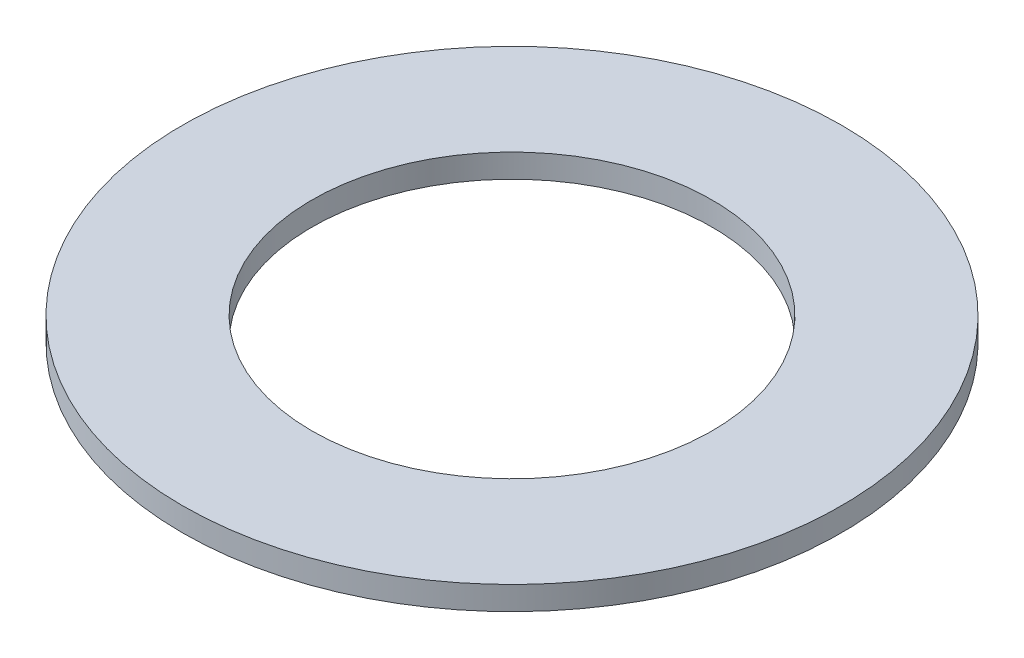
ISO-10303-21;
HEADER;
FILE_DESCRIPTION(('STEP AP214'),'2;1');
FILE_NAME('part.step','',(''),(''),'','','');
FILE_SCHEMA(('AUTOMOTIVE_DESIGN { 1 0 10303 214 1 1 1 1 }'));
ENDSEC;
DATA;
#1=APPLICATION_CONTEXT('core data for automotive mechanical design processes');
#2=APPLICATION_PROTOCOL_DEFINITION('international standard','automotive_design',2000,#1);
#3=PRODUCT_CONTEXT('',#1,'mechanical');
#4=PRODUCT('Part','Part','',(#3));
#5=PRODUCT_RELATED_PRODUCT_CATEGORY('part','',(#4));
#6=PRODUCT_DEFINITION_FORMATION('','',#4);
#7=PRODUCT_DEFINITION_CONTEXT('part definition',#1,'design');
#8=PRODUCT_DEFINITION('design','',#6,#7);
#9=PRODUCT_DEFINITION_SHAPE('','',#8);
#10=(LENGTH_UNIT() NAMED_UNIT(*) SI_UNIT(.MILLI.,.METRE.));
#11=(NAMED_UNIT(*) PLANE_ANGLE_UNIT() SI_UNIT($,.RADIAN.));
#12=(NAMED_UNIT(*) SI_UNIT($,.STERADIAN.) SOLID_ANGLE_UNIT());
#13=UNCERTAINTY_MEASURE_WITH_UNIT(LENGTH_MEASURE(1.E-05),#10,'distance_accuracy_value','');
#14=(GEOMETRIC_REPRESENTATION_CONTEXT(3) GLOBAL_UNCERTAINTY_ASSIGNED_CONTEXT((#13)) GLOBAL_UNIT_ASSIGNED_CONTEXT((#10,
#11,#12)) REPRESENTATION_CONTEXT('',''));
#15=CARTESIAN_POINT('',(0.,0.,0.));
#16=DIRECTION('',(0.,0.,1.));
#17=DIRECTION('',(1.,0.,0.));
#18=AXIS2_PLACEMENT_3D('',#15,#16,#17);
#19=CARTESIAN_POINT('',(0.,5.,0.));
#20=DIRECTION('',(0.,-1.,0.));
#21=DIRECTION('',(0.,0.,-1.));
#22=AXIS2_PLACEMENT_3D('',#19,#20,#21);
#23=CYLINDRICAL_SURFACE('',#22,70.);
#24=CARTESIAN_POINT('',(0.,5.,0.));
#25=DIRECTION('',(0.,1.,0.));
#26=DIRECTION('',(0.,0.,1.));
#27=AXIS2_PLACEMENT_3D('',#24,#25,#26);
#28=CIRCLE('',#27,70.);
#29=CARTESIAN_POINT('',(0.,5.,70.));
#30=VERTEX_POINT('',#29);
#31=EDGE_CURVE('E10',#30,#30,#28,.T.);
#32=ORIENTED_EDGE('',*,*,#31,.F.);
#33=EDGE_LOOP('',(#32));
#34=FACE_BOUND('',#33,.T.);
#35=CARTESIAN_POINT('',(0.,0.,0.));
#36=DIRECTION('',(0.,1.,0.));
#37=DIRECTION('',(0.,0.,1.));
#38=AXIS2_PLACEMENT_3D('',#35,#36,#37);
#39=CIRCLE('',#38,70.);
#40=CARTESIAN_POINT('',(0.,0.,70.));
#41=VERTEX_POINT('',#40);
#42=EDGE_CURVE('E37',#41,#41,#39,.T.);
#43=ORIENTED_EDGE('',*,*,#42,.T.);
#44=EDGE_LOOP('',(#43));
#45=FACE_BOUND('',#44,.T.);
#46=ADVANCED_FACE('F40',(#34,#45),#23,.T.);
#47=CARTESIAN_POINT('',(0.,5.,0.));
#48=DIRECTION('',(0.,1.,0.));
#49=DIRECTION('',(0.,0.,1.));
#50=AXIS2_PLACEMENT_3D('',#47,#48,#49);
#51=PLANE('',#50);
#52=CARTESIAN_POINT('',(0.,5.,0.));
#53=DIRECTION('',(0.,1.,0.));
#54=DIRECTION('',(0.,0.,1.));
#55=AXIS2_PLACEMENT_3D('',#52,#53,#54);
#56=CIRCLE('',#55,42.5);
#57=CARTESIAN_POINT('',(0.,5.,42.5));
#58=VERTEX_POINT('',#57);
#59=EDGE_CURVE('E50',#58,#58,#56,.T.);
#60=ORIENTED_EDGE('',*,*,#59,.F.);
#61=EDGE_LOOP('',(#60));
#62=FACE_BOUND('',#61,.T.);
#63=ORIENTED_EDGE('',*,*,#31,.T.);
#64=EDGE_LOOP('',(#63));
#65=FACE_BOUND('',#64,.T.);
#66=ADVANCED_FACE('F59',(#62,#65),#51,.T.);
#67=CARTESIAN_POINT('',(0.,0.,0.));
#68=DIRECTION('',(0.,1.,0.));
#69=DIRECTION('',(0.,0.,1.));
#70=AXIS2_PLACEMENT_3D('',#67,#68,#69);
#71=PLANE('',#70);
#72=CARTESIAN_POINT('',(0.,0.,0.));
#73=DIRECTION('',(0.,1.,0.));
#74=DIRECTION('',(0.,0.,1.));
#75=AXIS2_PLACEMENT_3D('',#72,#73,#74);
#76=CIRCLE('',#75,42.5);
#77=CARTESIAN_POINT('',(0.,0.,42.5));
#78=VERTEX_POINT('',#77);
#79=EDGE_CURVE('E47',#78,#78,#76,.T.);
#80=ORIENTED_EDGE('',*,*,#79,.T.);
#81=EDGE_LOOP('',(#80));
#82=FACE_BOUND('',#81,.T.);
#83=ORIENTED_EDGE('',*,*,#42,.F.);
#84=EDGE_LOOP('',(#83));
#85=FACE_BOUND('',#84,.T.);
#86=ADVANCED_FACE('F58',(#82,#85),#71,.F.);
#87=CARTESIAN_POINT('',(0.,5.,0.));
#88=DIRECTION('',(0.,-1.,0.));
#89=DIRECTION('',(0.,0.,-1.));
#90=AXIS2_PLACEMENT_3D('',#87,#88,#89);
#91=CYLINDRICAL_SURFACE('',#90,42.5);
#92=ORIENTED_EDGE('',*,*,#59,.T.);
#93=EDGE_LOOP('',(#92));
#94=FACE_BOUND('',#93,.T.);
#95=ORIENTED_EDGE('',*,*,#79,.F.);
#96=EDGE_LOOP('',(#95));
#97=FACE_BOUND('',#96,.T.);
#98=ADVANCED_FACE('F54',(#94,#97),#91,.F.);
#99=CLOSED_SHELL('',(#46,#66,#86,#98));
#100=MANIFOLD_SOLID_BREP('B2',#99);
#101=ADVANCED_BREP_SHAPE_REPRESENTATION('',(#18,#100),#14);
#102=SHAPE_DEFINITION_REPRESENTATION(#9,#101);
ENDSEC;
END-ISO-10303-21;
